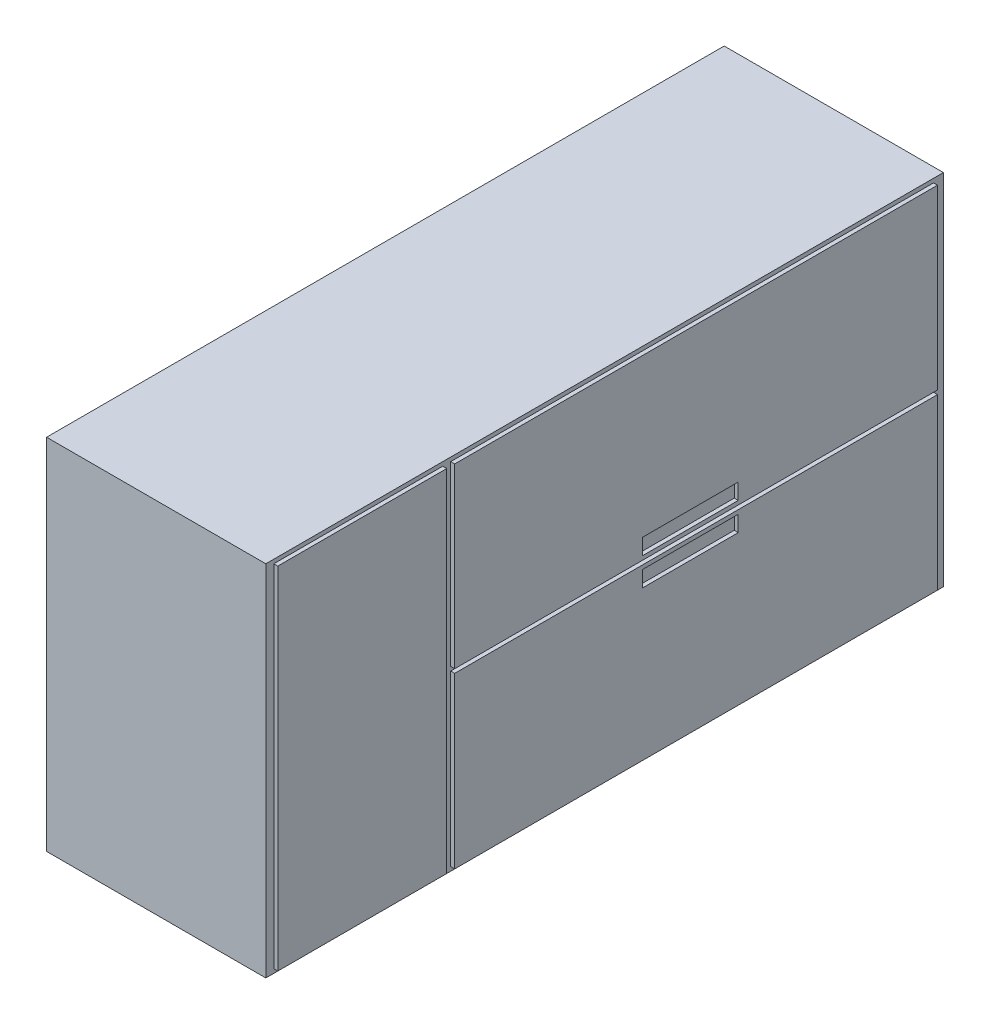
ISO-10303-21;
HEADER;
FILE_DESCRIPTION(('STEP AP214'),'2;1');
FILE_NAME('part.step','',(''),(''),'','','');
FILE_SCHEMA(('AUTOMOTIVE_DESIGN { 1 0 10303 214 1 1 1 1 }'));
ENDSEC;
DATA;
#1=APPLICATION_CONTEXT('core data for automotive mechanical design processes');
#2=APPLICATION_PROTOCOL_DEFINITION('international standard','automotive_design',2000,#1);
#3=PRODUCT_CONTEXT('',#1,'mechanical');
#4=PRODUCT('Part','Part','',(#3));
#5=PRODUCT_RELATED_PRODUCT_CATEGORY('part','',(#4));
#6=PRODUCT_DEFINITION_FORMATION('','',#4);
#7=PRODUCT_DEFINITION_CONTEXT('part definition',#1,'design');
#8=PRODUCT_DEFINITION('design','',#6,#7);
#9=PRODUCT_DEFINITION_SHAPE('','',#8);
#10=(LENGTH_UNIT() NAMED_UNIT(*) SI_UNIT(.MILLI.,.METRE.));
#11=(NAMED_UNIT(*) PLANE_ANGLE_UNIT() SI_UNIT($,.RADIAN.));
#12=(NAMED_UNIT(*) SI_UNIT($,.STERADIAN.) SOLID_ANGLE_UNIT());
#13=UNCERTAINTY_MEASURE_WITH_UNIT(LENGTH_MEASURE(1.E-05),#10,'distance_accuracy_value','');
#14=(GEOMETRIC_REPRESENTATION_CONTEXT(3) GLOBAL_UNCERTAINTY_ASSIGNED_CONTEXT((#13)) GLOBAL_UNIT_ASSIGNED_CONTEXT((#10,
#11,#12)) REPRESENTATION_CONTEXT('',''));
#15=CARTESIAN_POINT('',(0.,0.,0.));
#16=DIRECTION('',(0.,0.,1.));
#17=DIRECTION('',(1.,0.,0.));
#18=AXIS2_PLACEMENT_3D('',#15,#16,#17);
#19=CARTESIAN_POINT('',(0.,0.,1700.));
#20=DIRECTION('',(-1.,0.,0.));
#21=DIRECTION('',(0.,-1.,0.));
#22=AXIS2_PLACEMENT_3D('',#19,#20,#21);
#23=PLANE('',#22);
#24=DIRECTION('',(0.,1.,0.));
#25=VECTOR('',#24,1.);
#26=CARTESIAN_POINT('',(0.,0.,0.));
#27=LINE('',#26,#25);
#28=CARTESIAN_POINT('',(1.10218211923262E-13,-900.,0.));
#29=VERTEX_POINT('',#28);
#30=CARTESIAN_POINT('',(0.,0.,0.));
#31=VERTEX_POINT('',#30);
#32=EDGE_CURVE('E357',#29,#31,#27,.T.);
#33=ORIENTED_EDGE('',*,*,#32,.T.);
#34=DIRECTION('',(0.,0.,-1.));
#35=VECTOR('',#34,1.);
#36=CARTESIAN_POINT('',(0.,0.,1700.));
#37=LINE('',#36,#35);
#38=CARTESIAN_POINT('',(0.,0.,1700.));
#39=VERTEX_POINT('',#38);
#40=EDGE_CURVE('E11',#39,#31,#37,.T.);
#41=ORIENTED_EDGE('',*,*,#40,.F.);
#42=DIRECTION('',(0.,1.,0.));
#43=VECTOR('',#42,1.);
#44=CARTESIAN_POINT('',(0.,0.,1700.));
#45=LINE('',#44,#43);
#46=CARTESIAN_POINT('',(1.10218211923262E-13,-900.,1700.));
#47=VERTEX_POINT('',#46);
#48=EDGE_CURVE('E358',#47,#39,#45,.T.);
#49=ORIENTED_EDGE('',*,*,#48,.F.);
#50=DIRECTION('',(0.,0.,-1.));
#51=VECTOR('',#50,1.);
#52=CARTESIAN_POINT('',(1.10218211923262E-13,-900.,1700.));
#53=LINE('',#52,#51);
#54=EDGE_CURVE('E368',#47,#29,#53,.T.);
#55=ORIENTED_EDGE('',*,*,#54,.T.);
#56=EDGE_LOOP('',(#33,#41,#49,#55));
#57=FACE_BOUND('',#56,.T.);
#58=DIRECTION('',(0.,1.,0.));
#59=VECTOR('',#58,1.);
#60=CARTESIAN_POINT('',(0.,-10.,1256.09100901831));
#61=LINE('',#60,#59);
#62=CARTESIAN_POINT('',(1.08993565124114E-13,-890.,1256.09100901831));
#63=VERTEX_POINT('',#62);
#64=CARTESIAN_POINT('',(0.,-10.,1256.09100901831));
#65=VERTEX_POINT('',#64);
#66=EDGE_CURVE('E324',#63,#65,#61,.T.);
#67=ORIENTED_EDGE('',*,*,#66,.F.);
#68=DIRECTION('',(0.,0.,-1.));
#69=VECTOR('',#68,1.);
#70=CARTESIAN_POINT('',(1.08993565124114E-13,-890.,1256.09100901831));
#71=LINE('',#70,#69);
#72=CARTESIAN_POINT('',(1.08993565124114E-13,-890.,1680.));
#73=VERTEX_POINT('',#72);
#74=EDGE_CURVE('E329',#73,#63,#71,.T.);
#75=ORIENTED_EDGE('',*,*,#74,.F.);
#76=DIRECTION('',(0.,-1.,0.));
#77=VECTOR('',#76,1.);
#78=CARTESIAN_POINT('',(0.,-10.,1680.));
#79=LINE('',#78,#77);
#80=CARTESIAN_POINT('',(0.,-10.,1680.));
#81=VERTEX_POINT('',#80);
#82=EDGE_CURVE('E341',#81,#73,#79,.T.);
#83=ORIENTED_EDGE('',*,*,#82,.F.);
#84=DIRECTION('',(0.,0.,1.));
#85=VECTOR('',#84,1.);
#86=CARTESIAN_POINT('',(0.,-10.,1256.09100901831));
#87=LINE('',#86,#85);
#88=EDGE_CURVE('E338',#65,#81,#87,.T.);
#89=ORIENTED_EDGE('',*,*,#88,.F.);
#90=EDGE_LOOP('',(#67,#75,#83,#89));
#91=FACE_BOUND('',#90,.T.);
#92=DIRECTION('',(0.,-1.,0.));
#93=VECTOR('',#92,1.);
#94=CARTESIAN_POINT('',(0.,-10.,1236.09100901831));
#95=LINE('',#94,#93);
#96=CARTESIAN_POINT('',(0.,-10.,1236.09100901831));
#97=VERTEX_POINT('',#96);
#98=CARTESIAN_POINT('',(0.,-455.,1236.09100901831));
#99=VERTEX_POINT('',#98);
#100=EDGE_CURVE('E291',#97,#99,#95,.T.);
#101=ORIENTED_EDGE('',*,*,#100,.F.);
#102=DIRECTION('',(0.,0.,1.));
#103=VECTOR('',#102,1.);
#104=CARTESIAN_POINT('',(0.,-10.,1236.09100901831));
#105=LINE('',#104,#103);
#106=CARTESIAN_POINT('',(0.,-10.,24.7667950344854));
#107=VERTEX_POINT('',#106);
#108=EDGE_CURVE('E296',#107,#97,#105,.T.);
#109=ORIENTED_EDGE('',*,*,#108,.F.);
#110=DIRECTION('',(0.,1.,0.));
#111=VECTOR('',#110,1.);
#112=CARTESIAN_POINT('',(0.,-10.,24.7667950344855));
#113=LINE('',#112,#111);
#114=CARTESIAN_POINT('',(0.,-455.,24.7667950344859));
#115=VERTEX_POINT('',#114);
#116=EDGE_CURVE('E308',#115,#107,#113,.T.);
#117=ORIENTED_EDGE('',*,*,#116,.F.);
#118=DIRECTION('',(0.,0.,-1.));
#119=VECTOR('',#118,1.);
#120=CARTESIAN_POINT('',(0.,-455.,1236.09100901831));
#121=LINE('',#120,#119);
#122=EDGE_CURVE('E305',#99,#115,#121,.T.);
#123=ORIENTED_EDGE('',*,*,#122,.F.);
#124=EDGE_LOOP('',(#101,#109,#117,#123));
#125=FACE_BOUND('',#124,.T.);
#126=DIRECTION('',(0.,-1.,0.));
#127=VECTOR('',#126,1.);
#128=CARTESIAN_POINT('',(0.,-465.,1236.09100901831));
#129=LINE('',#128,#127);
#130=CARTESIAN_POINT('',(0.,-465.,1236.09100901831));
#131=VERTEX_POINT('',#130);
#132=CARTESIAN_POINT('',(1.08993565124114E-13,-890.,1236.09100901831));
#133=VERTEX_POINT('',#132);
#134=EDGE_CURVE('E210',#131,#133,#129,.T.);
#135=ORIENTED_EDGE('',*,*,#134,.F.);
#136=DIRECTION('',(0.,0.,1.));
#137=VECTOR('',#136,1.);
#138=CARTESIAN_POINT('',(0.,-465.,1236.09100901831));
#139=LINE('',#138,#137);
#140=CARTESIAN_POINT('',(0.,-465.,24.7667950344856));
#141=VERTEX_POINT('',#140);
#142=EDGE_CURVE('E238',#141,#131,#139,.T.);
#143=ORIENTED_EDGE('',*,*,#142,.F.);
#144=DIRECTION('',(0.,1.,0.));
#145=VECTOR('',#144,1.);
#146=CARTESIAN_POINT('',(0.,-465.,24.7667950344856));
#147=LINE('',#146,#145);
#148=CARTESIAN_POINT('',(1.08993565124114E-13,-890.,24.7667950344855));
#149=VERTEX_POINT('',#148);
#150=EDGE_CURVE('E52',#149,#141,#147,.T.);
#151=ORIENTED_EDGE('',*,*,#150,.F.);
#152=DIRECTION('',(0.,0.,-1.));
#153=VECTOR('',#152,1.);
#154=CARTESIAN_POINT('',(1.08993565124114E-13,-890.,1236.09100901831));
#155=LINE('',#154,#153);
#156=EDGE_CURVE('E47',#133,#149,#155,.T.);
#157=ORIENTED_EDGE('',*,*,#156,.F.);
#158=EDGE_LOOP('',(#135,#143,#151,#157));
#159=FACE_BOUND('',#158,.T.);
#160=ADVANCED_FACE('F32',(#57,#91,#125,#159),#23,.F.);
#161=CARTESIAN_POINT('',(0.,0.,1700.));
#162=DIRECTION('',(0.,-1.,0.));
#163=DIRECTION('',(1.,0.,0.));
#164=AXIS2_PLACEMENT_3D('',#161,#162,#163);
#165=PLANE('',#164);
#166=DIRECTION('',(-1.,0.,0.));
#167=VECTOR('',#166,1.);
#168=CARTESIAN_POINT('',(0.,0.,0.));
#169=LINE('',#168,#167);
#170=CARTESIAN_POINT('',(-550.,0.,0.));
#171=VERTEX_POINT('',#170);
#172=EDGE_CURVE('E371',#31,#171,#169,.T.);
#173=ORIENTED_EDGE('',*,*,#172,.T.);
#174=DIRECTION('',(0.,0.,-1.));
#175=VECTOR('',#174,1.);
#176=CARTESIAN_POINT('',(-550.,0.,1700.));
#177=LINE('',#176,#175);
#178=CARTESIAN_POINT('',(-550.,0.,1700.));
#179=VERTEX_POINT('',#178);
#180=EDGE_CURVE('E40',#179,#171,#177,.T.);
#181=ORIENTED_EDGE('',*,*,#180,.F.);
#182=DIRECTION('',(-1.,0.,0.));
#183=VECTOR('',#182,1.);
#184=CARTESIAN_POINT('',(0.,0.,1700.));
#185=LINE('',#184,#183);
#186=EDGE_CURVE('E361',#39,#179,#185,.T.);
#187=ORIENTED_EDGE('',*,*,#186,.F.);
#188=ORIENTED_EDGE('',*,*,#40,.T.);
#189=EDGE_LOOP('',(#173,#181,#187,#188));
#190=FACE_BOUND('',#189,.T.);
#191=ADVANCED_FACE('F402',(#190),#165,.F.);
#192=CARTESIAN_POINT('',(-550.,0.,1700.));
#193=DIRECTION('',(1.,0.,0.));
#194=DIRECTION('',(0.,1.,0.));
#195=AXIS2_PLACEMENT_3D('',#192,#193,#194);
#196=PLANE('',#195);
#197=DIRECTION('',(0.,-1.,0.));
#198=VECTOR('',#197,1.);
#199=CARTESIAN_POINT('',(-550.,0.,0.));
#200=LINE('',#199,#198);
#201=CARTESIAN_POINT('',(-550.,-900.,0.));
#202=VERTEX_POINT('',#201);
#203=EDGE_CURVE('E373',#171,#202,#200,.T.);
#204=ORIENTED_EDGE('',*,*,#203,.T.);
#205=DIRECTION('',(0.,0.,-1.));
#206=VECTOR('',#205,1.);
#207=CARTESIAN_POINT('',(-550.,-900.,1700.));
#208=LINE('',#207,#206);
#209=CARTESIAN_POINT('',(-550.,-900.,1700.));
#210=VERTEX_POINT('',#209);
#211=EDGE_CURVE('E378',#210,#202,#208,.T.);
#212=ORIENTED_EDGE('',*,*,#211,.F.);
#213=DIRECTION('',(0.,-1.,0.));
#214=VECTOR('',#213,1.);
#215=CARTESIAN_POINT('',(-550.,0.,1700.));
#216=LINE('',#215,#214);
#217=EDGE_CURVE('E364',#179,#210,#216,.T.);
#218=ORIENTED_EDGE('',*,*,#217,.F.);
#219=ORIENTED_EDGE('',*,*,#180,.T.);
#220=EDGE_LOOP('',(#204,#212,#218,#219));
#221=FACE_BOUND('',#220,.T.);
#222=ADVANCED_FACE('F385',(#221),#196,.F.);
#223=CARTESIAN_POINT('',(1.10218211923262E-13,-900.,1700.));
#224=DIRECTION('',(0.,1.,0.));
#225=DIRECTION('',(-1.,0.,0.));
#226=AXIS2_PLACEMENT_3D('',#223,#224,#225);
#227=PLANE('',#226);
#228=DIRECTION('',(1.,0.,0.));
#229=VECTOR('',#228,1.);
#230=CARTESIAN_POINT('',(1.10218211923262E-13,-900.,0.));
#231=LINE('',#230,#229);
#232=EDGE_CURVE('E362',#202,#29,#231,.T.);
#233=ORIENTED_EDGE('',*,*,#232,.T.);
#234=ORIENTED_EDGE('',*,*,#54,.F.);
#235=DIRECTION('',(1.,0.,0.));
#236=VECTOR('',#235,1.);
#237=CARTESIAN_POINT('',(1.10218211923262E-13,-900.,1700.));
#238=LINE('',#237,#236);
#239=EDGE_CURVE('E366',#210,#47,#238,.T.);
#240=ORIENTED_EDGE('',*,*,#239,.F.);
#241=ORIENTED_EDGE('',*,*,#211,.T.);
#242=EDGE_LOOP('',(#233,#234,#240,#241));
#243=FACE_BOUND('',#242,.T.);
#244=ADVANCED_FACE('F394',(#243),#227,.F.);
#245=CARTESIAN_POINT('',(0.,0.,1700.));
#246=DIRECTION('',(0.,0.,-1.));
#247=DIRECTION('',(-1.,0.,0.));
#248=AXIS2_PLACEMENT_3D('',#245,#246,#247);
#249=PLANE('',#248);
#250=ORIENTED_EDGE('',*,*,#48,.T.);
#251=ORIENTED_EDGE('',*,*,#186,.T.);
#252=ORIENTED_EDGE('',*,*,#217,.T.);
#253=ORIENTED_EDGE('',*,*,#239,.T.);
#254=EDGE_LOOP('',(#250,#251,#252,#253));
#255=FACE_BOUND('',#254,.T.);
#256=ADVANCED_FACE('F401',(#255),#249,.F.);
#257=CARTESIAN_POINT('',(0.,0.,0.));
#258=DIRECTION('',(0.,0.,-1.));
#259=DIRECTION('',(-1.,0.,0.));
#260=AXIS2_PLACEMENT_3D('',#257,#258,#259);
#261=PLANE('',#260);
#262=ORIENTED_EDGE('',*,*,#32,.F.);
#263=ORIENTED_EDGE('',*,*,#232,.F.);
#264=ORIENTED_EDGE('',*,*,#203,.F.);
#265=ORIENTED_EDGE('',*,*,#172,.F.);
#266=EDGE_LOOP('',(#262,#263,#264,#265));
#267=FACE_BOUND('',#266,.T.);
#268=ADVANCED_FACE('F391',(#267),#261,.T.);
#269=CARTESIAN_POINT('',(10.,-10.,1256.09100901831));
#270=DIRECTION('',(0.,0.,1.));
#271=DIRECTION('',(1.,0.,0.));
#272=AXIS2_PLACEMENT_3D('',#269,#270,#271);
#273=PLANE('',#272);
#274=ORIENTED_EDGE('',*,*,#66,.T.);
#275=DIRECTION('',(-1.,0.,0.));
#276=VECTOR('',#275,1.);
#277=CARTESIAN_POINT('',(10.,-10.,1256.09100901831));
#278=LINE('',#277,#276);
#279=CARTESIAN_POINT('',(10.,-10.,1256.09100901831));
#280=VERTEX_POINT('',#279);
#281=EDGE_CURVE('E354',#280,#65,#278,.T.);
#282=ORIENTED_EDGE('',*,*,#281,.F.);
#283=DIRECTION('',(0.,1.,0.));
#284=VECTOR('',#283,1.);
#285=CARTESIAN_POINT('',(10.,-10.,1256.09100901831));
#286=LINE('',#285,#284);
#287=CARTESIAN_POINT('',(10.0000000000001,-890.,1256.09100901831));
#288=VERTEX_POINT('',#287);
#289=EDGE_CURVE('E325',#288,#280,#286,.T.);
#290=ORIENTED_EDGE('',*,*,#289,.F.);
#291=DIRECTION('',(-1.,0.,0.));
#292=VECTOR('',#291,1.);
#293=CARTESIAN_POINT('',(10.0000000000001,-890.,1256.09100901831));
#294=LINE('',#293,#292);
#295=EDGE_CURVE('E335',#288,#63,#294,.T.);
#296=ORIENTED_EDGE('',*,*,#295,.T.);
#297=EDGE_LOOP('',(#274,#282,#290,#296));
#298=FACE_BOUND('',#297,.T.);
#299=ADVANCED_FACE('F415',(#298),#273,.F.);
#300=CARTESIAN_POINT('',(10.,-10.,1256.09100901831));
#301=DIRECTION('',(0.,-1.,0.));
#302=DIRECTION('',(1.,0.,0.));
#303=AXIS2_PLACEMENT_3D('',#300,#301,#302);
#304=PLANE('',#303);
#305=ORIENTED_EDGE('',*,*,#88,.T.);
#306=DIRECTION('',(-1.,0.,0.));
#307=VECTOR('',#306,1.);
#308=CARTESIAN_POINT('',(10.,-10.,1680.));
#309=LINE('',#308,#307);
#310=CARTESIAN_POINT('',(10.,-10.,1680.));
#311=VERTEX_POINT('',#310);
#312=EDGE_CURVE('E351',#311,#81,#309,.T.);
#313=ORIENTED_EDGE('',*,*,#312,.F.);
#314=DIRECTION('',(0.,0.,1.));
#315=VECTOR('',#314,1.);
#316=CARTESIAN_POINT('',(10.,-10.,1256.09100901831));
#317=LINE('',#316,#315);
#318=EDGE_CURVE('E328',#280,#311,#317,.T.);
#319=ORIENTED_EDGE('',*,*,#318,.F.);
#320=ORIENTED_EDGE('',*,*,#281,.T.);
#321=EDGE_LOOP('',(#305,#313,#319,#320));
#322=FACE_BOUND('',#321,.T.);
#323=ADVANCED_FACE('F420',(#322),#304,.F.);
#324=CARTESIAN_POINT('',(10.,-10.,1680.));
#325=DIRECTION('',(0.,0.,-1.));
#326=DIRECTION('',(-1.,0.,0.));
#327=AXIS2_PLACEMENT_3D('',#324,#325,#326);
#328=PLANE('',#327);
#329=ORIENTED_EDGE('',*,*,#82,.T.);
#330=DIRECTION('',(-1.,0.,0.));
#331=VECTOR('',#330,1.);
#332=CARTESIAN_POINT('',(10.0000000000001,-890.,1680.));
#333=LINE('',#332,#331);
#334=CARTESIAN_POINT('',(10.0000000000001,-890.,1680.));
#335=VERTEX_POINT('',#334);
#336=EDGE_CURVE('E348',#335,#73,#333,.T.);
#337=ORIENTED_EDGE('',*,*,#336,.F.);
#338=DIRECTION('',(0.,-1.,0.));
#339=VECTOR('',#338,1.);
#340=CARTESIAN_POINT('',(10.,-10.,1680.));
#341=LINE('',#340,#339);
#342=EDGE_CURVE('E331',#311,#335,#341,.T.);
#343=ORIENTED_EDGE('',*,*,#342,.F.);
#344=ORIENTED_EDGE('',*,*,#312,.T.);
#345=EDGE_LOOP('',(#329,#337,#343,#344));
#346=FACE_BOUND('',#345,.T.);
#347=ADVANCED_FACE('F424',(#346),#328,.F.);
#348=CARTESIAN_POINT('',(10.0000000000001,-890.,1256.09100901831));
#349=DIRECTION('',(0.,1.,0.));
#350=DIRECTION('',(-1.,0.,0.));
#351=AXIS2_PLACEMENT_3D('',#348,#349,#350);
#352=PLANE('',#351);
#353=ORIENTED_EDGE('',*,*,#74,.T.);
#354=ORIENTED_EDGE('',*,*,#295,.F.);
#355=DIRECTION('',(0.,0.,-1.));
#356=VECTOR('',#355,1.);
#357=CARTESIAN_POINT('',(10.0000000000001,-890.,1256.09100901831));
#358=LINE('',#357,#356);
#359=EDGE_CURVE('E333',#335,#288,#358,.T.);
#360=ORIENTED_EDGE('',*,*,#359,.F.);
#361=ORIENTED_EDGE('',*,*,#336,.T.);
#362=EDGE_LOOP('',(#353,#354,#360,#361));
#363=FACE_BOUND('',#362,.T.);
#364=ADVANCED_FACE('F428',(#363),#352,.F.);
#365=CARTESIAN_POINT('',(10.,0.,0.));
#366=DIRECTION('',(-1.,0.,0.));
#367=DIRECTION('',(0.,-1.,0.));
#368=AXIS2_PLACEMENT_3D('',#365,#366,#367);
#369=PLANE('',#368);
#370=ORIENTED_EDGE('',*,*,#289,.T.);
#371=ORIENTED_EDGE('',*,*,#318,.T.);
#372=ORIENTED_EDGE('',*,*,#342,.T.);
#373=ORIENTED_EDGE('',*,*,#359,.T.);
#374=EDGE_LOOP('',(#370,#371,#372,#373));
#375=FACE_BOUND('',#374,.T.);
#376=ADVANCED_FACE('F432',(#375),#369,.F.);
#377=CARTESIAN_POINT('',(10.,0.,0.));
#378=DIRECTION('',(1.,0.,0.));
#379=DIRECTION('',(0.,1.,0.));
#380=AXIS2_PLACEMENT_3D('',#377,#378,#379);
#381=PLANE('',#380);
#382=DIRECTION('',(0.,-1.,0.));
#383=VECTOR('',#382,1.);
#384=CARTESIAN_POINT('',(10.,-10.,1236.09100901831));
#385=LINE('',#384,#383);
#386=CARTESIAN_POINT('',(10.,-10.,1236.09100901831));
#387=VERTEX_POINT('',#386);
#388=CARTESIAN_POINT('',(10.0000000000001,-455.,1236.09100901831));
#389=VERTEX_POINT('',#388);
#390=EDGE_CURVE('E292',#387,#389,#385,.T.);
#391=ORIENTED_EDGE('',*,*,#390,.T.);
#392=DIRECTION('',(0.,0.,-1.));
#393=VECTOR('',#392,1.);
#394=CARTESIAN_POINT('',(10.0000000000001,-455.,1236.09100901831));
#395=LINE('',#394,#393);
#396=CARTESIAN_POINT('',(10.0000000000001,-455.,24.7667950344858));
#397=VERTEX_POINT('',#396);
#398=EDGE_CURVE('E295',#389,#397,#395,.T.);
#399=ORIENTED_EDGE('',*,*,#398,.T.);
#400=DIRECTION('',(0.,1.,0.));
#401=VECTOR('',#400,1.);
#402=CARTESIAN_POINT('',(10.,-10.,24.7667950344855));
#403=LINE('',#402,#401);
#404=CARTESIAN_POINT('',(10.,-10.,24.7667950344855));
#405=VERTEX_POINT('',#404);
#406=EDGE_CURVE('E298',#397,#405,#403,.T.);
#407=ORIENTED_EDGE('',*,*,#406,.T.);
#408=DIRECTION('',(0.,0.,1.));
#409=VECTOR('',#408,1.);
#410=CARTESIAN_POINT('',(10.,-10.,1236.09100901831));
#411=LINE('',#410,#409);
#412=EDGE_CURVE('E300',#405,#387,#411,.T.);
#413=ORIENTED_EDGE('',*,*,#412,.T.);
#414=EDGE_LOOP('',(#391,#399,#407,#413));
#415=FACE_BOUND('',#414,.T.);
#416=DIRECTION('',(0.,0.,-1.));
#417=VECTOR('',#416,1.);
#418=CARTESIAN_POINT('',(10.0000000000001,-445.,764.725938911738));
#419=LINE('',#418,#417);
#420=CARTESIAN_POINT('',(10.0000000000001,-445.,764.725938911738));
#421=VERTEX_POINT('',#420);
#422=CARTESIAN_POINT('',(10.0000000000001,-445.,524.725938911738));
#423=VERTEX_POINT('',#422);
#424=EDGE_CURVE('E264',#421,#423,#419,.T.);
#425=ORIENTED_EDGE('',*,*,#424,.F.);
#426=DIRECTION('',(0.,-1.,0.));
#427=VECTOR('',#426,1.);
#428=CARTESIAN_POINT('',(10.0000000000001,-445.,764.725938911738));
#429=LINE('',#428,#427);
#430=CARTESIAN_POINT('',(10.,-405.,764.725938911738));
#431=VERTEX_POINT('',#430);
#432=EDGE_CURVE('E262',#431,#421,#429,.T.);
#433=ORIENTED_EDGE('',*,*,#432,.F.);
#434=DIRECTION('',(0.,0.,1.));
#435=VECTOR('',#434,1.);
#436=CARTESIAN_POINT('',(10.,-405.,764.725938911738));
#437=LINE('',#436,#435);
#438=CARTESIAN_POINT('',(10.,-405.,524.725938911738));
#439=VERTEX_POINT('',#438);
#440=EDGE_CURVE('E270',#439,#431,#437,.T.);
#441=ORIENTED_EDGE('',*,*,#440,.F.);
#442=DIRECTION('',(0.,1.,0.));
#443=VECTOR('',#442,1.);
#444=CARTESIAN_POINT('',(10.0000000000001,-445.,524.725938911738));
#445=LINE('',#444,#443);
#446=EDGE_CURVE('E267',#423,#439,#445,.T.);
#447=ORIENTED_EDGE('',*,*,#446,.F.);
#448=EDGE_LOOP('',(#425,#433,#441,#447));
#449=FACE_BOUND('',#448,.T.);
#450=ADVANCED_FACE('F436',(#415,#449),#381,.T.);
#451=CARTESIAN_POINT('',(10.,-10.,1236.09100901831));
#452=DIRECTION('',(0.,0.,-1.));
#453=DIRECTION('',(-1.,0.,0.));
#454=AXIS2_PLACEMENT_3D('',#451,#452,#453);
#455=PLANE('',#454);
#456=ORIENTED_EDGE('',*,*,#100,.T.);
#457=DIRECTION('',(-1.,0.,0.));
#458=VECTOR('',#457,1.);
#459=CARTESIAN_POINT('',(10.0000000000001,-455.,1236.09100901831));
#460=LINE('',#459,#458);
#461=EDGE_CURVE('E321',#389,#99,#460,.T.);
#462=ORIENTED_EDGE('',*,*,#461,.F.);
#463=ORIENTED_EDGE('',*,*,#390,.F.);
#464=DIRECTION('',(-1.,0.,0.));
#465=VECTOR('',#464,1.);
#466=CARTESIAN_POINT('',(10.,-10.,1236.09100901831));
#467=LINE('',#466,#465);
#468=EDGE_CURVE('E302',#387,#97,#467,.T.);
#469=ORIENTED_EDGE('',*,*,#468,.T.);
#470=EDGE_LOOP('',(#456,#462,#463,#469));
#471=FACE_BOUND('',#470,.T.);
#472=ADVANCED_FACE('F438',(#471),#455,.F.);
#473=CARTESIAN_POINT('',(10.0000000000001,-455.,1236.09100901831));
#474=DIRECTION('',(0.,1.,0.));
#475=DIRECTION('',(-1.,0.,0.));
#476=AXIS2_PLACEMENT_3D('',#473,#474,#475);
#477=PLANE('',#476);
#478=ORIENTED_EDGE('',*,*,#122,.T.);
#479=DIRECTION('',(-1.,0.,0.));
#480=VECTOR('',#479,1.);
#481=CARTESIAN_POINT('',(10.0000000000001,-455.,24.7667950344858));
#482=LINE('',#481,#480);
#483=EDGE_CURVE('E318',#397,#115,#482,.T.);
#484=ORIENTED_EDGE('',*,*,#483,.F.);
#485=ORIENTED_EDGE('',*,*,#398,.F.);
#486=ORIENTED_EDGE('',*,*,#461,.T.);
#487=EDGE_LOOP('',(#478,#484,#485,#486));
#488=FACE_BOUND('',#487,.T.);
#489=ADVANCED_FACE('F441',(#488),#477,.F.);
#490=CARTESIAN_POINT('',(10.,-10.,24.7667950344855));
#491=DIRECTION('',(0.,0.,1.));
#492=DIRECTION('',(0.,-1.,0.));
#493=AXIS2_PLACEMENT_3D('',#490,#491,#492);
#494=PLANE('',#493);
#495=ORIENTED_EDGE('',*,*,#116,.T.);
#496=DIRECTION('',(-1.,0.,0.));
#497=VECTOR('',#496,1.);
#498=CARTESIAN_POINT('',(10.,-10.,24.7667950344855));
#499=LINE('',#498,#497);
#500=EDGE_CURVE('E315',#405,#107,#499,.T.);
#501=ORIENTED_EDGE('',*,*,#500,.F.);
#502=ORIENTED_EDGE('',*,*,#406,.F.);
#503=ORIENTED_EDGE('',*,*,#483,.T.);
#504=EDGE_LOOP('',(#495,#501,#502,#503));
#505=FACE_BOUND('',#504,.T.);
#506=ADVANCED_FACE('F445',(#505),#494,.F.);
#507=CARTESIAN_POINT('',(10.,-10.,1236.09100901831));
#508=DIRECTION('',(0.,-1.,0.));
#509=DIRECTION('',(1.,0.,0.));
#510=AXIS2_PLACEMENT_3D('',#507,#508,#509);
#511=PLANE('',#510);
#512=ORIENTED_EDGE('',*,*,#108,.T.);
#513=ORIENTED_EDGE('',*,*,#468,.F.);
#514=ORIENTED_EDGE('',*,*,#412,.F.);
#515=ORIENTED_EDGE('',*,*,#500,.T.);
#516=EDGE_LOOP('',(#512,#513,#514,#515));
#517=FACE_BOUND('',#516,.T.);
#518=ADVANCED_FACE('F449',(#517),#511,.F.);
#519=CARTESIAN_POINT('',(10.0000000000001,-445.,764.725938911738));
#520=DIRECTION('',(0.,0.,-1.));
#521=DIRECTION('',(-1.,0.,0.));
#522=AXIS2_PLACEMENT_3D('',#519,#520,#521);
#523=PLANE('',#522);
#524=DIRECTION('',(0.,-1.,0.));
#525=VECTOR('',#524,1.);
#526=CARTESIAN_POINT('',(0.,-445.,764.725938911738));
#527=LINE('',#526,#525);
#528=CARTESIAN_POINT('',(0.,-405.,764.725938911738));
#529=VERTEX_POINT('',#528);
#530=CARTESIAN_POINT('',(0.,-445.,764.725938911738));
#531=VERTEX_POINT('',#530);
#532=EDGE_CURVE('E261',#529,#531,#527,.T.);
#533=ORIENTED_EDGE('',*,*,#532,.F.);
#534=DIRECTION('',(-1.,0.,0.));
#535=VECTOR('',#534,1.);
#536=CARTESIAN_POINT('',(10.,-405.,764.725938911738));
#537=LINE('',#536,#535);
#538=EDGE_CURVE('E272',#431,#529,#537,.T.);
#539=ORIENTED_EDGE('',*,*,#538,.F.);
#540=ORIENTED_EDGE('',*,*,#432,.T.);
#541=DIRECTION('',(-1.,0.,0.));
#542=VECTOR('',#541,1.);
#543=CARTESIAN_POINT('',(10.0000000000001,-445.,764.725938911738));
#544=LINE('',#543,#542);
#545=EDGE_CURVE('E288',#421,#531,#544,.T.);
#546=ORIENTED_EDGE('',*,*,#545,.T.);
#547=EDGE_LOOP('',(#533,#539,#540,#546));
#548=FACE_BOUND('',#547,.T.);
#549=ADVANCED_FACE('F453',(#548),#523,.T.);
#550=CARTESIAN_POINT('',(10.0000000000001,-445.,764.725938911738));
#551=DIRECTION('',(0.,1.,0.));
#552=DIRECTION('',(-1.,0.,0.));
#553=AXIS2_PLACEMENT_3D('',#550,#551,#552);
#554=PLANE('',#553);
#555=DIRECTION('',(0.,0.,-1.));
#556=VECTOR('',#555,1.);
#557=CARTESIAN_POINT('',(0.,-445.,764.725938911738));
#558=LINE('',#557,#556);
#559=CARTESIAN_POINT('',(0.,-445.,524.725938911738));
#560=VERTEX_POINT('',#559);
#561=EDGE_CURVE('E275',#531,#560,#558,.T.);
#562=ORIENTED_EDGE('',*,*,#561,.F.);
#563=ORIENTED_EDGE('',*,*,#545,.F.);
#564=ORIENTED_EDGE('',*,*,#424,.T.);
#565=DIRECTION('',(-1.,0.,0.));
#566=VECTOR('',#565,1.);
#567=CARTESIAN_POINT('',(10.0000000000001,-445.,524.725938911738));
#568=LINE('',#567,#566);
#569=EDGE_CURVE('E286',#423,#560,#568,.T.);
#570=ORIENTED_EDGE('',*,*,#569,.T.);
#571=EDGE_LOOP('',(#562,#563,#564,#570));
#572=FACE_BOUND('',#571,.T.);
#573=ADVANCED_FACE('F460',(#572),#554,.T.);
#574=CARTESIAN_POINT('',(10.0000000000001,-445.,524.725938911738));
#575=DIRECTION('',(0.,0.,1.));
#576=DIRECTION('',(1.,0.,0.));
#577=AXIS2_PLACEMENT_3D('',#574,#575,#576);
#578=PLANE('',#577);
#579=DIRECTION('',(0.,1.,0.));
#580=VECTOR('',#579,1.);
#581=CARTESIAN_POINT('',(0.,-445.,524.725938911738));
#582=LINE('',#581,#580);
#583=CARTESIAN_POINT('',(0.,-405.,524.725938911738));
#584=VERTEX_POINT('',#583);
#585=EDGE_CURVE('E278',#560,#584,#582,.T.);
#586=ORIENTED_EDGE('',*,*,#585,.F.);
#587=ORIENTED_EDGE('',*,*,#569,.F.);
#588=ORIENTED_EDGE('',*,*,#446,.T.);
#589=DIRECTION('',(-1.,0.,0.));
#590=VECTOR('',#589,1.);
#591=CARTESIAN_POINT('',(10.,-405.,524.725938911738));
#592=LINE('',#591,#590);
#593=EDGE_CURVE('E284',#439,#584,#592,.T.);
#594=ORIENTED_EDGE('',*,*,#593,.T.);
#595=EDGE_LOOP('',(#586,#587,#588,#594));
#596=FACE_BOUND('',#595,.T.);
#597=ADVANCED_FACE('F464',(#596),#578,.T.);
#598=CARTESIAN_POINT('',(10.,-405.,764.725938911738));
#599=DIRECTION('',(0.,-1.,0.));
#600=DIRECTION('',(1.,0.,0.));
#601=AXIS2_PLACEMENT_3D('',#598,#599,#600);
#602=PLANE('',#601);
#603=DIRECTION('',(0.,0.,1.));
#604=VECTOR('',#603,1.);
#605=CARTESIAN_POINT('',(0.,-405.,764.725938911738));
#606=LINE('',#605,#604);
#607=EDGE_CURVE('E265',#584,#529,#606,.T.);
#608=ORIENTED_EDGE('',*,*,#607,.F.);
#609=ORIENTED_EDGE('',*,*,#593,.F.);
#610=ORIENTED_EDGE('',*,*,#440,.T.);
#611=ORIENTED_EDGE('',*,*,#538,.T.);
#612=EDGE_LOOP('',(#608,#609,#610,#611));
#613=FACE_BOUND('',#612,.T.);
#614=ADVANCED_FACE('F468',(#613),#602,.T.);
#615=ORIENTED_EDGE('',*,*,#607,.T.);
#616=ORIENTED_EDGE('',*,*,#532,.T.);
#617=ORIENTED_EDGE('',*,*,#561,.T.);
#618=ORIENTED_EDGE('',*,*,#585,.T.);
#619=EDGE_LOOP('',(#615,#616,#617,#618));
#620=FACE_BOUND('',#619,.T.);
#621=ADVANCED_FACE('F34',(#620),#23,.F.);
#622=CARTESIAN_POINT('',(10.,0.,0.));
#623=DIRECTION('',(1.,0.,0.));
#624=DIRECTION('',(0.,1.,0.));
#625=AXIS2_PLACEMENT_3D('',#622,#623,#624);
#626=PLANE('',#625);
#627=DIRECTION('',(0.,-1.,0.));
#628=VECTOR('',#627,1.);
#629=CARTESIAN_POINT('',(10.0000000000001,-465.,1236.09100901831));
#630=LINE('',#629,#628);
#631=CARTESIAN_POINT('',(10.0000000000001,-465.,1236.09100901831));
#632=VERTEX_POINT('',#631);
#633=CARTESIAN_POINT('',(10.0000000000001,-890.,1236.09100901831));
#634=VERTEX_POINT('',#633);
#635=EDGE_CURVE('E234',#632,#634,#630,.T.);
#636=ORIENTED_EDGE('',*,*,#635,.T.);
#637=DIRECTION('',(0.,0.,-1.));
#638=VECTOR('',#637,1.);
#639=CARTESIAN_POINT('',(10.0000000000001,-890.,1236.09100901831));
#640=LINE('',#639,#638);
#641=CARTESIAN_POINT('',(10.0000000000001,-890.,24.7667950344856));
#642=VERTEX_POINT('',#641);
#643=EDGE_CURVE('E237',#634,#642,#640,.T.);
#644=ORIENTED_EDGE('',*,*,#643,.T.);
#645=DIRECTION('',(0.,1.,0.));
#646=VECTOR('',#645,1.);
#647=CARTESIAN_POINT('',(10.0000000000001,-465.,24.7667950344856));
#648=LINE('',#647,#646);
#649=CARTESIAN_POINT('',(10.0000000000001,-465.,24.7667950344856));
#650=VERTEX_POINT('',#649);
#651=EDGE_CURVE('E240',#642,#650,#648,.T.);
#652=ORIENTED_EDGE('',*,*,#651,.T.);
#653=DIRECTION('',(0.,0.,1.));
#654=VECTOR('',#653,1.);
#655=CARTESIAN_POINT('',(10.0000000000001,-465.,1236.09100901831));
#656=LINE('',#655,#654);
#657=EDGE_CURVE('E242',#650,#632,#656,.T.);
#658=ORIENTED_EDGE('',*,*,#657,.T.);
#659=EDGE_LOOP('',(#636,#644,#652,#658));
#660=FACE_BOUND('',#659,.T.);
#661=DIRECTION('',(0.,0.,-1.));
#662=VECTOR('',#661,1.);
#663=CARTESIAN_POINT('',(10.0000000000001,-515.,764.725938911738));
#664=LINE('',#663,#662);
#665=CARTESIAN_POINT('',(10.0000000000001,-515.,764.725938911738));
#666=VERTEX_POINT('',#665);
#667=CARTESIAN_POINT('',(10.0000000000001,-515.,524.725938911738));
#668=VERTEX_POINT('',#667);
#669=EDGE_CURVE('E202',#666,#668,#664,.T.);
#670=ORIENTED_EDGE('',*,*,#669,.F.);
#671=DIRECTION('',(0.,-1.,0.));
#672=VECTOR('',#671,1.);
#673=CARTESIAN_POINT('',(10.0000000000001,-475.,764.725938911738));
#674=LINE('',#673,#672);
#675=CARTESIAN_POINT('',(10.0000000000001,-475.,764.725938911738));
#676=VERTEX_POINT('',#675);
#677=EDGE_CURVE('E192',#676,#666,#674,.T.);
#678=ORIENTED_EDGE('',*,*,#677,.F.);
#679=DIRECTION('',(0.,0.,1.));
#680=VECTOR('',#679,1.);
#681=CARTESIAN_POINT('',(10.0000000000001,-475.,764.725938911738));
#682=LINE('',#681,#680);
#683=CARTESIAN_POINT('',(10.0000000000001,-475.,524.725938911738));
#684=VERTEX_POINT('',#683);
#685=EDGE_CURVE('E218',#684,#676,#682,.T.);
#686=ORIENTED_EDGE('',*,*,#685,.F.);
#687=DIRECTION('',(0.,1.,0.));
#688=VECTOR('',#687,1.);
#689=CARTESIAN_POINT('',(10.0000000000001,-475.,524.725938911738));
#690=LINE('',#689,#688);
#691=EDGE_CURVE('E216',#668,#684,#690,.T.);
#692=ORIENTED_EDGE('',*,*,#691,.F.);
#693=EDGE_LOOP('',(#670,#678,#686,#692));
#694=FACE_BOUND('',#693,.T.);
#695=ADVANCED_FACE('F214',(#660,#694),#626,.T.);
#696=CARTESIAN_POINT('',(10.0000000000001,-465.,1236.09100901831));
#697=DIRECTION('',(0.,0.,-1.));
#698=DIRECTION('',(-1.,0.,0.));
#699=AXIS2_PLACEMENT_3D('',#696,#697,#698);
#700=PLANE('',#699);
#701=ORIENTED_EDGE('',*,*,#134,.T.);
#702=DIRECTION('',(-1.,0.,0.));
#703=VECTOR('',#702,1.);
#704=CARTESIAN_POINT('',(10.0000000000001,-890.,1236.09100901831));
#705=LINE('',#704,#703);
#706=EDGE_CURVE('E259',#634,#133,#705,.T.);
#707=ORIENTED_EDGE('',*,*,#706,.F.);
#708=ORIENTED_EDGE('',*,*,#635,.F.);
#709=DIRECTION('',(-1.,0.,0.));
#710=VECTOR('',#709,1.);
#711=CARTESIAN_POINT('',(10.0000000000001,-465.,1236.09100901831));
#712=LINE('',#711,#710);
#713=EDGE_CURVE('E244',#632,#131,#712,.T.);
#714=ORIENTED_EDGE('',*,*,#713,.T.);
#715=EDGE_LOOP('',(#701,#707,#708,#714));
#716=FACE_BOUND('',#715,.T.);
#717=ADVANCED_FACE('F473',(#716),#700,.F.);
#718=CARTESIAN_POINT('',(10.0000000000001,-890.,1236.09100901831));
#719=DIRECTION('',(0.,1.,0.));
#720=DIRECTION('',(-1.,0.,0.));
#721=AXIS2_PLACEMENT_3D('',#718,#719,#720);
#722=PLANE('',#721);
#723=ORIENTED_EDGE('',*,*,#156,.T.);
#724=DIRECTION('',(-1.,0.,0.));
#725=VECTOR('',#724,1.);
#726=CARTESIAN_POINT('',(10.0000000000001,-890.,24.7667950344856));
#727=LINE('',#726,#725);
#728=EDGE_CURVE('E256',#642,#149,#727,.T.);
#729=ORIENTED_EDGE('',*,*,#728,.F.);
#730=ORIENTED_EDGE('',*,*,#643,.F.);
#731=ORIENTED_EDGE('',*,*,#706,.T.);
#732=EDGE_LOOP('',(#723,#729,#730,#731));
#733=FACE_BOUND('',#732,.T.);
#734=ADVANCED_FACE('F476',(#733),#722,.F.);
#735=CARTESIAN_POINT('',(10.0000000000001,-465.,24.7667950344856));
#736=DIRECTION('',(0.,0.,1.));
#737=DIRECTION('',(0.,-1.,0.));
#738=AXIS2_PLACEMENT_3D('',#735,#736,#737);
#739=PLANE('',#738);
#740=ORIENTED_EDGE('',*,*,#150,.T.);
#741=DIRECTION('',(-1.,0.,0.));
#742=VECTOR('',#741,1.);
#743=CARTESIAN_POINT('',(10.0000000000001,-465.,24.7667950344856));
#744=LINE('',#743,#742);
#745=EDGE_CURVE('E253',#650,#141,#744,.T.);
#746=ORIENTED_EDGE('',*,*,#745,.F.);
#747=ORIENTED_EDGE('',*,*,#651,.F.);
#748=ORIENTED_EDGE('',*,*,#728,.T.);
#749=EDGE_LOOP('',(#740,#746,#747,#748));
#750=FACE_BOUND('',#749,.T.);
#751=ADVANCED_FACE('F480',(#750),#739,.F.);
#752=CARTESIAN_POINT('',(10.0000000000001,-465.,1236.09100901831));
#753=DIRECTION('',(0.,-1.,0.));
#754=DIRECTION('',(1.,0.,0.));
#755=AXIS2_PLACEMENT_3D('',#752,#753,#754);
#756=PLANE('',#755);
#757=ORIENTED_EDGE('',*,*,#142,.T.);
#758=ORIENTED_EDGE('',*,*,#713,.F.);
#759=ORIENTED_EDGE('',*,*,#657,.F.);
#760=ORIENTED_EDGE('',*,*,#745,.T.);
#761=EDGE_LOOP('',(#757,#758,#759,#760));
#762=FACE_BOUND('',#761,.T.);
#763=ADVANCED_FACE('F484',(#762),#756,.F.);
#764=CARTESIAN_POINT('',(10.0000000000001,-475.,764.725938911738));
#765=DIRECTION('',(0.,0.,-1.));
#766=DIRECTION('',(-1.,0.,0.));
#767=AXIS2_PLACEMENT_3D('',#764,#765,#766);
#768=PLANE('',#767);
#769=DIRECTION('',(0.,-1.,0.));
#770=VECTOR('',#769,1.);
#771=CARTESIAN_POINT('',(0.,-475.,764.725938911738));
#772=LINE('',#771,#770);
#773=CARTESIAN_POINT('',(0.,-475.,764.725938911738));
#774=VERTEX_POINT('',#773);
#775=CARTESIAN_POINT('',(0.,-515.,764.725938911738));
#776=VERTEX_POINT('',#775);
#777=EDGE_CURVE('E222',#774,#776,#772,.T.);
#778=ORIENTED_EDGE('',*,*,#777,.F.);
#779=DIRECTION('',(-1.,0.,0.));
#780=VECTOR('',#779,1.);
#781=CARTESIAN_POINT('',(10.0000000000001,-475.,764.725938911738));
#782=LINE('',#781,#780);
#783=EDGE_CURVE('E198',#676,#774,#782,.T.);
#784=ORIENTED_EDGE('',*,*,#783,.F.);
#785=ORIENTED_EDGE('',*,*,#677,.T.);
#786=DIRECTION('',(-1.,0.,0.));
#787=VECTOR('',#786,1.);
#788=CARTESIAN_POINT('',(10.0000000000001,-515.,764.725938911738));
#789=LINE('',#788,#787);
#790=EDGE_CURVE('E196',#666,#776,#789,.T.);
#791=ORIENTED_EDGE('',*,*,#790,.T.);
#792=EDGE_LOOP('',(#778,#784,#785,#791));
#793=FACE_BOUND('',#792,.T.);
#794=ADVANCED_FACE('F195',(#793),#768,.T.);
#795=CARTESIAN_POINT('',(10.0000000000001,-515.,764.725938911738));
#796=DIRECTION('',(0.,1.,0.));
#797=DIRECTION('',(-1.,0.,0.));
#798=AXIS2_PLACEMENT_3D('',#795,#796,#797);
#799=PLANE('',#798);
#800=DIRECTION('',(0.,0.,-1.));
#801=VECTOR('',#800,1.);
#802=CARTESIAN_POINT('',(0.,-515.,764.725938911738));
#803=LINE('',#802,#801);
#804=CARTESIAN_POINT('',(0.,-515.,524.725938911738));
#805=VERTEX_POINT('',#804);
#806=EDGE_CURVE('E209',#776,#805,#803,.T.);
#807=ORIENTED_EDGE('',*,*,#806,.F.);
#808=ORIENTED_EDGE('',*,*,#790,.F.);
#809=ORIENTED_EDGE('',*,*,#669,.T.);
#810=DIRECTION('',(-1.,0.,0.));
#811=VECTOR('',#810,1.);
#812=CARTESIAN_POINT('',(10.0000000000001,-515.,524.725938911738));
#813=LINE('',#812,#811);
#814=EDGE_CURVE('E211',#668,#805,#813,.T.);
#815=ORIENTED_EDGE('',*,*,#814,.T.);
#816=EDGE_LOOP('',(#807,#808,#809,#815));
#817=FACE_BOUND('',#816,.T.);
#818=ADVANCED_FACE('F206',(#817),#799,.T.);
#819=CARTESIAN_POINT('',(10.0000000000001,-475.,524.725938911738));
#820=DIRECTION('',(0.,0.,1.));
#821=DIRECTION('',(1.,0.,0.));
#822=AXIS2_PLACEMENT_3D('',#819,#820,#821);
#823=PLANE('',#822);
#824=DIRECTION('',(0.,1.,0.));
#825=VECTOR('',#824,1.);
#826=CARTESIAN_POINT('',(0.,-475.,524.725938911738));
#827=LINE('',#826,#825);
#828=CARTESIAN_POINT('',(0.,-475.,524.725938911738));
#829=VERTEX_POINT('',#828);
#830=EDGE_CURVE('E225',#805,#829,#827,.T.);
#831=ORIENTED_EDGE('',*,*,#830,.F.);
#832=ORIENTED_EDGE('',*,*,#814,.F.);
#833=ORIENTED_EDGE('',*,*,#691,.T.);
#834=DIRECTION('',(-1.,0.,0.));
#835=VECTOR('',#834,1.);
#836=CARTESIAN_POINT('',(10.0000000000001,-475.,524.725938911738));
#837=LINE('',#836,#835);
#838=EDGE_CURVE('E231',#684,#829,#837,.T.);
#839=ORIENTED_EDGE('',*,*,#838,.T.);
#840=EDGE_LOOP('',(#831,#832,#833,#839));
#841=FACE_BOUND('',#840,.T.);
#842=ADVANCED_FACE('F496',(#841),#823,.T.);
#843=CARTESIAN_POINT('',(10.0000000000001,-475.,764.725938911738));
#844=DIRECTION('',(0.,-1.,0.));
#845=DIRECTION('',(1.,0.,0.));
#846=AXIS2_PLACEMENT_3D('',#843,#844,#845);
#847=PLANE('',#846);
#848=DIRECTION('',(0.,0.,1.));
#849=VECTOR('',#848,1.);
#850=CARTESIAN_POINT('',(0.,-475.,764.725938911738));
#851=LINE('',#850,#849);
#852=EDGE_CURVE('E203',#829,#774,#851,.T.);
#853=ORIENTED_EDGE('',*,*,#852,.F.);
#854=ORIENTED_EDGE('',*,*,#838,.F.);
#855=ORIENTED_EDGE('',*,*,#685,.T.);
#856=ORIENTED_EDGE('',*,*,#783,.T.);
#857=EDGE_LOOP('',(#853,#854,#855,#856));
#858=FACE_BOUND('',#857,.T.);
#859=ADVANCED_FACE('F499',(#858),#847,.T.);
#860=ORIENTED_EDGE('',*,*,#852,.T.);
#861=ORIENTED_EDGE('',*,*,#777,.T.);
#862=ORIENTED_EDGE('',*,*,#806,.T.);
#863=ORIENTED_EDGE('',*,*,#830,.T.);
#864=EDGE_LOOP('',(#860,#861,#862,#863));
#865=FACE_BOUND('',#864,.T.);
#866=ADVANCED_FACE('F409',(#865),#23,.F.);
#867=CLOSED_SHELL('',(#160,#191,#222,#244,#256,#268,#299,#323,#347,#364,#376,#450,#472,#489,
#506,#518,#549,#573,#597,#614,#621,#695,#717,#734,#751,#763,#794,#818,#842,#859,#866));
#868=MANIFOLD_SOLID_BREP('B2',#867);
#869=ADVANCED_BREP_SHAPE_REPRESENTATION('',(#18,#868),#14);
#870=SHAPE_DEFINITION_REPRESENTATION(#9,#869);
ENDSEC;
END-ISO-10303-21;
